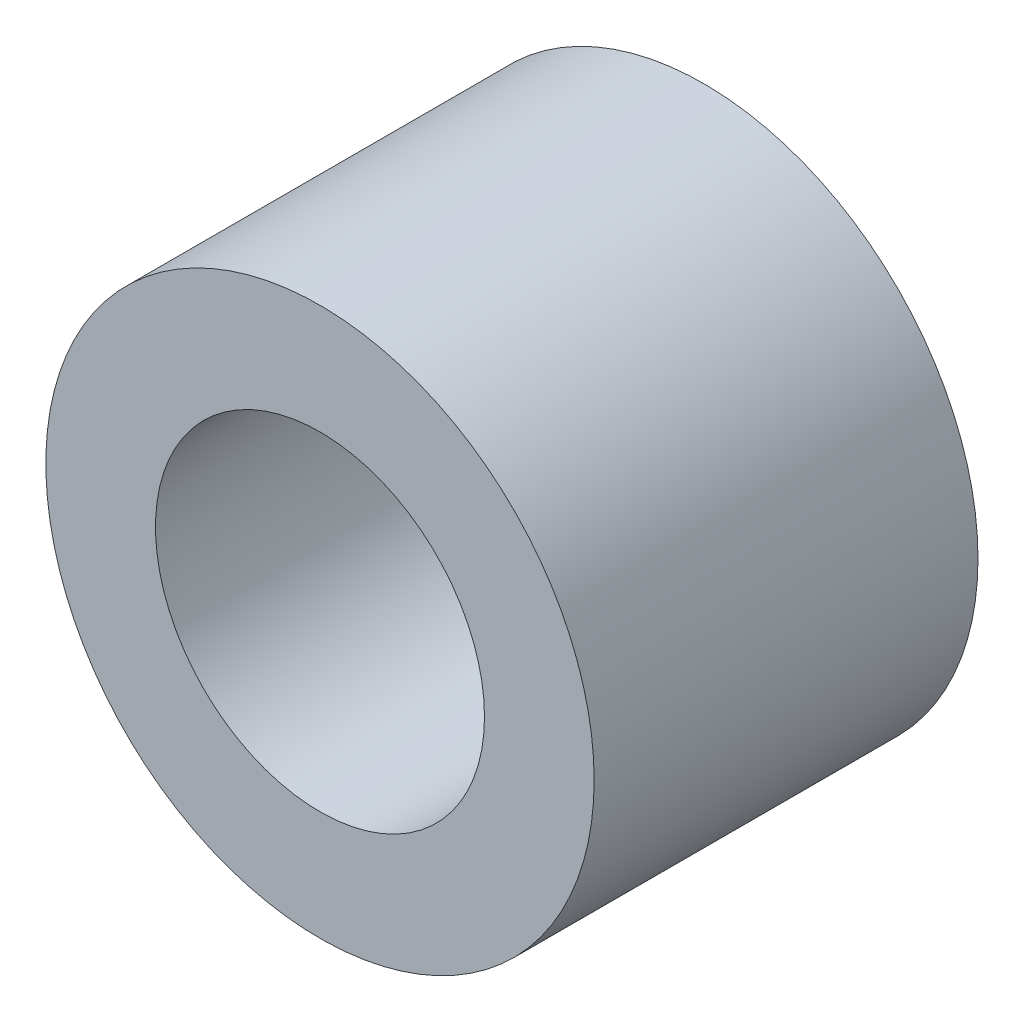
ISO-10303-21;
HEADER;
FILE_DESCRIPTION(('STEP AP214'),'2;1');
FILE_NAME('part.step','',(''),(''),'','','');
FILE_SCHEMA(('AUTOMOTIVE_DESIGN { 1 0 10303 214 1 1 1 1 }'));
ENDSEC;
DATA;
#1=APPLICATION_CONTEXT('core data for automotive mechanical design processes');
#2=APPLICATION_PROTOCOL_DEFINITION('international standard','automotive_design',2000,#1);
#3=PRODUCT_CONTEXT('',#1,'mechanical');
#4=PRODUCT('Part','Part','',(#3));
#5=PRODUCT_RELATED_PRODUCT_CATEGORY('part','',(#4));
#6=PRODUCT_DEFINITION_FORMATION('','',#4);
#7=PRODUCT_DEFINITION_CONTEXT('part definition',#1,'design');
#8=PRODUCT_DEFINITION('design','',#6,#7);
#9=PRODUCT_DEFINITION_SHAPE('','',#8);
#10=(LENGTH_UNIT() NAMED_UNIT(*) SI_UNIT(.MILLI.,.METRE.));
#11=(NAMED_UNIT(*) PLANE_ANGLE_UNIT() SI_UNIT($,.RADIAN.));
#12=(NAMED_UNIT(*) SI_UNIT($,.STERADIAN.) SOLID_ANGLE_UNIT());
#13=UNCERTAINTY_MEASURE_WITH_UNIT(LENGTH_MEASURE(1.E-05),#10,'distance_accuracy_value','');
#14=(GEOMETRIC_REPRESENTATION_CONTEXT(3) GLOBAL_UNCERTAINTY_ASSIGNED_CONTEXT((#13)) GLOBAL_UNIT_ASSIGNED_CONTEXT((#10,
#11,#12)) REPRESENTATION_CONTEXT('',''));
#15=CARTESIAN_POINT('',(0.,0.,0.));
#16=DIRECTION('',(0.,0.,1.));
#17=DIRECTION('',(1.,0.,0.));
#18=AXIS2_PLACEMENT_3D('',#15,#16,#17);
#19=CARTESIAN_POINT('',(0.,0.,3.5));
#20=DIRECTION('',(0.,0.,1.));
#21=DIRECTION('',(1.,0.,0.));
#22=AXIS2_PLACEMENT_3D('',#19,#20,#21);
#23=PLANE('',#22);
#24=CARTESIAN_POINT('',(0.,0.,3.5));
#25=DIRECTION('',(0.,0.,1.));
#26=DIRECTION('',(1.,0.,0.));
#27=AXIS2_PLACEMENT_3D('',#24,#25,#26);
#28=CIRCLE('',#27,2.5);
#29=CARTESIAN_POINT('',(2.5,0.,3.5));
#30=VERTEX_POINT('',#29);
#31=EDGE_CURVE('E10',#30,#30,#28,.T.);
#32=ORIENTED_EDGE('',*,*,#31,.T.);
#33=EDGE_LOOP('',(#32));
#34=FACE_BOUND('',#33,.T.);
#35=CARTESIAN_POINT('',(0.,0.,3.5));
#36=DIRECTION('',(0.,0.,1.));
#37=DIRECTION('',(1.,0.,0.));
#38=AXIS2_PLACEMENT_3D('',#35,#36,#37);
#39=CIRCLE('',#38,1.5);
#40=CARTESIAN_POINT('',(1.5,0.,3.5));
#41=VERTEX_POINT('',#40);
#42=EDGE_CURVE('E46',#41,#41,#39,.T.);
#43=ORIENTED_EDGE('',*,*,#42,.F.);
#44=EDGE_LOOP('',(#43));
#45=FACE_BOUND('',#44,.T.);
#46=ADVANCED_FACE('F35',(#34,#45),#23,.T.);
#47=CARTESIAN_POINT('',(0.,0.,0.));
#48=DIRECTION('',(0.,0.,1.));
#49=DIRECTION('',(1.,0.,0.));
#50=AXIS2_PLACEMENT_3D('',#47,#48,#49);
#51=PLANE('',#50);
#52=CARTESIAN_POINT('',(0.,0.,0.));
#53=DIRECTION('',(0.,0.,1.));
#54=DIRECTION('',(1.,0.,0.));
#55=AXIS2_PLACEMENT_3D('',#52,#53,#54);
#56=CIRCLE('',#55,2.5);
#57=CARTESIAN_POINT('',(2.5,0.,0.));
#58=VERTEX_POINT('',#57);
#59=EDGE_CURVE('E39',#58,#58,#56,.T.);
#60=ORIENTED_EDGE('',*,*,#59,.F.);
#61=EDGE_LOOP('',(#60));
#62=FACE_BOUND('',#61,.T.);
#63=CARTESIAN_POINT('',(0.,0.,0.));
#64=DIRECTION('',(0.,0.,1.));
#65=DIRECTION('',(1.,0.,0.));
#66=AXIS2_PLACEMENT_3D('',#63,#64,#65);
#67=CIRCLE('',#66,1.5);
#68=CARTESIAN_POINT('',(1.5,0.,0.));
#69=VERTEX_POINT('',#68);
#70=EDGE_CURVE('E48',#69,#69,#67,.T.);
#71=ORIENTED_EDGE('',*,*,#70,.T.);
#72=EDGE_LOOP('',(#71));
#73=FACE_BOUND('',#72,.T.);
#74=ADVANCED_FACE('F58',(#62,#73),#51,.F.);
#75=CARTESIAN_POINT('',(0.,0.,3.5));
#76=DIRECTION('',(0.,0.,-1.));
#77=DIRECTION('',(-1.,0.,0.));
#78=AXIS2_PLACEMENT_3D('',#75,#76,#77);
#79=CYLINDRICAL_SURFACE('',#78,2.5);
#80=ORIENTED_EDGE('',*,*,#31,.F.);
#81=EDGE_LOOP('',(#80));
#82=FACE_BOUND('',#81,.T.);
#83=ORIENTED_EDGE('',*,*,#59,.T.);
#84=EDGE_LOOP('',(#83));
#85=FACE_BOUND('',#84,.T.);
#86=ADVANCED_FACE('F37',(#82,#85),#79,.T.);
#87=CARTESIAN_POINT('',(0.,0.,3.5));
#88=DIRECTION('',(0.,0.,-1.));
#89=DIRECTION('',(-1.,0.,0.));
#90=AXIS2_PLACEMENT_3D('',#87,#88,#89);
#91=CYLINDRICAL_SURFACE('',#90,1.5);
#92=ORIENTED_EDGE('',*,*,#42,.T.);
#93=EDGE_LOOP('',(#92));
#94=FACE_BOUND('',#93,.T.);
#95=ORIENTED_EDGE('',*,*,#70,.F.);
#96=EDGE_LOOP('',(#95));
#97=FACE_BOUND('',#96,.T.);
#98=ADVANCED_FACE('F54',(#94,#97),#91,.F.);
#99=CLOSED_SHELL('',(#46,#74,#86,#98));
#100=MANIFOLD_SOLID_BREP('B2',#99);
#101=ADVANCED_BREP_SHAPE_REPRESENTATION('',(#18,#100),#14);
#102=SHAPE_DEFINITION_REPRESENTATION(#9,#101);
ENDSEC;
END-ISO-10303-21;
